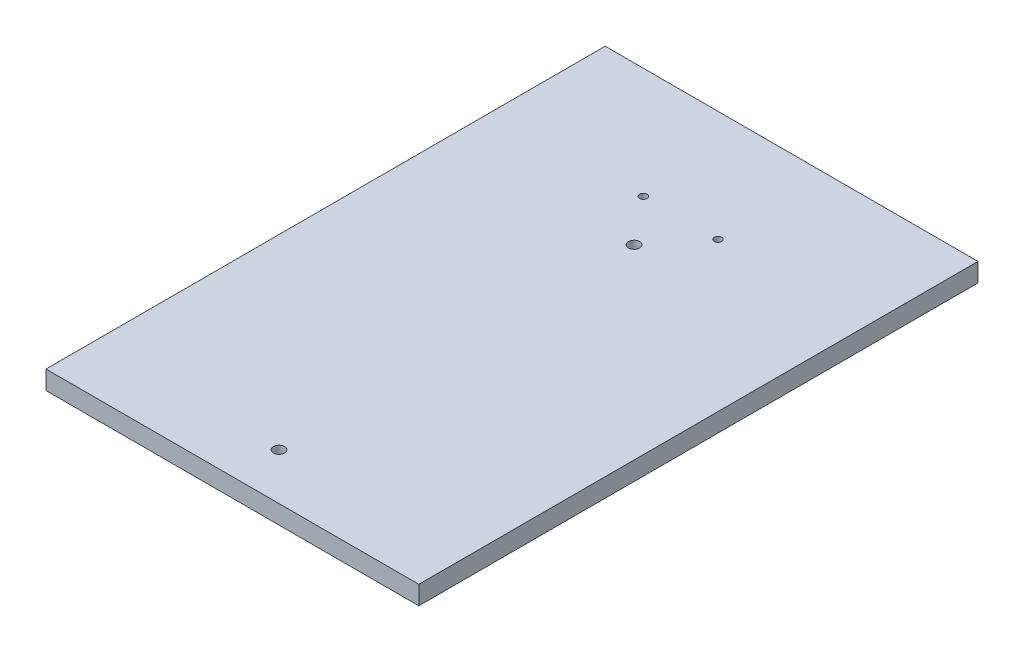
ISO-10303-21;
HEADER;
FILE_DESCRIPTION(('STEP AP214'),'2;1');
FILE_NAME('part.step','',(''),(''),'','','');
FILE_SCHEMA(('AUTOMOTIVE_DESIGN { 1 0 10303 214 1 1 1 1 }'));
ENDSEC;
DATA;
#1=APPLICATION_CONTEXT('core data for automotive mechanical design processes');
#2=APPLICATION_PROTOCOL_DEFINITION('international standard','automotive_design',2000,#1);
#3=PRODUCT_CONTEXT('',#1,'mechanical');
#4=PRODUCT('Part','Part','',(#3));
#5=PRODUCT_RELATED_PRODUCT_CATEGORY('part','',(#4));
#6=PRODUCT_DEFINITION_FORMATION('','',#4);
#7=PRODUCT_DEFINITION_CONTEXT('part definition',#1,'design');
#8=PRODUCT_DEFINITION('design','',#6,#7);
#9=PRODUCT_DEFINITION_SHAPE('','',#8);
#10=(LENGTH_UNIT() NAMED_UNIT(*) SI_UNIT(.MILLI.,.METRE.));
#11=(NAMED_UNIT(*) PLANE_ANGLE_UNIT() SI_UNIT($,.RADIAN.));
#12=(NAMED_UNIT(*) SI_UNIT($,.STERADIAN.) SOLID_ANGLE_UNIT());
#13=UNCERTAINTY_MEASURE_WITH_UNIT(LENGTH_MEASURE(1.E-05),#10,'distance_accuracy_value','');
#14=(GEOMETRIC_REPRESENTATION_CONTEXT(3) GLOBAL_UNCERTAINTY_ASSIGNED_CONTEXT((#13)) GLOBAL_UNIT_ASSIGNED_CONTEXT((#10,
#11,#12)) REPRESENTATION_CONTEXT('',''));
#15=CARTESIAN_POINT('',(0.,0.,0.));
#16=DIRECTION('',(0.,0.,1.));
#17=DIRECTION('',(1.,0.,0.));
#18=AXIS2_PLACEMENT_3D('',#15,#16,#17);
#19=CARTESIAN_POINT('',(-100.,10.,-150.));
#20=DIRECTION('',(1.,0.,0.));
#21=DIRECTION('',(0.,0.,-1.));
#22=AXIS2_PLACEMENT_3D('',#19,#20,#21);
#23=PLANE('',#22);
#24=DIRECTION('',(0.,0.,1.));
#25=VECTOR('',#24,1.);
#26=CARTESIAN_POINT('',(-100.,0.,-150.));
#27=LINE('',#26,#25);
#28=CARTESIAN_POINT('',(-100.,0.,-150.));
#29=VERTEX_POINT('',#28);
#30=CARTESIAN_POINT('',(-100.,0.,150.));
#31=VERTEX_POINT('',#30);
#32=EDGE_CURVE('E97',#29,#31,#27,.T.);
#33=ORIENTED_EDGE('',*,*,#32,.T.);
#34=DIRECTION('',(0.,-1.,0.));
#35=VECTOR('',#34,1.);
#36=CARTESIAN_POINT('',(-100.,10.,150.));
#37=LINE('',#36,#35);
#38=CARTESIAN_POINT('',(-100.,10.,150.));
#39=VERTEX_POINT('',#38);
#40=EDGE_CURVE('E11',#39,#31,#37,.T.);
#41=ORIENTED_EDGE('',*,*,#40,.F.);
#42=DIRECTION('',(0.,0.,1.));
#43=VECTOR('',#42,1.);
#44=CARTESIAN_POINT('',(-100.,10.,-150.));
#45=LINE('',#44,#43);
#46=CARTESIAN_POINT('',(-100.,10.,-150.));
#47=VERTEX_POINT('',#46);
#48=EDGE_CURVE('E85',#47,#39,#45,.T.);
#49=ORIENTED_EDGE('',*,*,#48,.F.);
#50=DIRECTION('',(0.,-1.,0.));
#51=VECTOR('',#50,1.);
#52=CARTESIAN_POINT('',(-100.,10.,-150.));
#53=LINE('',#52,#51);
#54=EDGE_CURVE('E93',#47,#29,#53,.T.);
#55=ORIENTED_EDGE('',*,*,#54,.T.);
#56=EDGE_LOOP('',(#33,#41,#49,#55));
#57=FACE_BOUND('',#56,.T.);
#58=ADVANCED_FACE('F34',(#57),#23,.F.);
#59=CARTESIAN_POINT('',(-100.,10.,150.));
#60=DIRECTION('',(0.,0.,-1.));
#61=DIRECTION('',(-1.,0.,0.));
#62=AXIS2_PLACEMENT_3D('',#59,#60,#61);
#63=PLANE('',#62);
#64=DIRECTION('',(1.,0.,0.));
#65=VECTOR('',#64,1.);
#66=CARTESIAN_POINT('',(-100.,0.,150.));
#67=LINE('',#66,#65);
#68=CARTESIAN_POINT('',(100.,0.,150.));
#69=VERTEX_POINT('',#68);
#70=EDGE_CURVE('E89',#31,#69,#67,.T.);
#71=ORIENTED_EDGE('',*,*,#70,.T.);
#72=DIRECTION('',(0.,-1.,0.));
#73=VECTOR('',#72,1.);
#74=CARTESIAN_POINT('',(100.,10.,150.));
#75=LINE('',#74,#73);
#76=CARTESIAN_POINT('',(100.,10.,150.));
#77=VERTEX_POINT('',#76);
#78=EDGE_CURVE('E42',#77,#69,#75,.T.);
#79=ORIENTED_EDGE('',*,*,#78,.F.);
#80=DIRECTION('',(1.,0.,0.));
#81=VECTOR('',#80,1.);
#82=CARTESIAN_POINT('',(-100.,10.,150.));
#83=LINE('',#82,#81);
#84=EDGE_CURVE('E80',#39,#77,#83,.T.);
#85=ORIENTED_EDGE('',*,*,#84,.F.);
#86=ORIENTED_EDGE('',*,*,#40,.T.);
#87=EDGE_LOOP('',(#71,#79,#85,#86));
#88=FACE_BOUND('',#87,.T.);
#89=ADVANCED_FACE('F88',(#88),#63,.F.);
#90=CARTESIAN_POINT('',(100.,10.,-150.));
#91=DIRECTION('',(-1.,0.,0.));
#92=DIRECTION('',(0.,0.,1.));
#93=AXIS2_PLACEMENT_3D('',#90,#91,#92);
#94=PLANE('',#93);
#95=DIRECTION('',(0.,0.,-1.));
#96=VECTOR('',#95,1.);
#97=CARTESIAN_POINT('',(100.,0.,-150.));
#98=LINE('',#97,#96);
#99=CARTESIAN_POINT('',(100.,0.,-150.));
#100=VERTEX_POINT('',#99);
#101=EDGE_CURVE('E67',#69,#100,#98,.T.);
#102=ORIENTED_EDGE('',*,*,#101,.T.);
#103=DIRECTION('',(0.,-1.,0.));
#104=VECTOR('',#103,1.);
#105=CARTESIAN_POINT('',(100.,10.,-150.));
#106=LINE('',#105,#104);
#107=CARTESIAN_POINT('',(100.,10.,-150.));
#108=VERTEX_POINT('',#107);
#109=EDGE_CURVE('E90',#108,#100,#106,.T.);
#110=ORIENTED_EDGE('',*,*,#109,.F.);
#111=DIRECTION('',(0.,0.,-1.));
#112=VECTOR('',#111,1.);
#113=CARTESIAN_POINT('',(100.,10.,-150.));
#114=LINE('',#113,#112);
#115=EDGE_CURVE('E83',#77,#108,#114,.T.);
#116=ORIENTED_EDGE('',*,*,#115,.F.);
#117=ORIENTED_EDGE('',*,*,#78,.T.);
#118=EDGE_LOOP('',(#102,#110,#116,#117));
#119=FACE_BOUND('',#118,.T.);
#120=ADVANCED_FACE('F91',(#119),#94,.F.);
#121=CARTESIAN_POINT('',(-100.,10.,-150.));
#122=DIRECTION('',(0.,0.,1.));
#123=DIRECTION('',(1.,0.,0.));
#124=AXIS2_PLACEMENT_3D('',#121,#122,#123);
#125=PLANE('',#124);
#126=DIRECTION('',(-1.,0.,0.));
#127=VECTOR('',#126,1.);
#128=CARTESIAN_POINT('',(-100.,0.,-150.));
#129=LINE('',#128,#127);
#130=EDGE_CURVE('E73',#100,#29,#129,.T.);
#131=ORIENTED_EDGE('',*,*,#130,.T.);
#132=ORIENTED_EDGE('',*,*,#54,.F.);
#133=DIRECTION('',(-1.,0.,0.));
#134=VECTOR('',#133,1.);
#135=CARTESIAN_POINT('',(-100.,10.,-150.));
#136=LINE('',#135,#134);
#137=EDGE_CURVE('E50',#108,#47,#136,.T.);
#138=ORIENTED_EDGE('',*,*,#137,.F.);
#139=ORIENTED_EDGE('',*,*,#109,.T.);
#140=EDGE_LOOP('',(#131,#132,#138,#139));
#141=FACE_BOUND('',#140,.T.);
#142=ADVANCED_FACE('F105',(#141),#125,.F.);
#143=CARTESIAN_POINT('',(0.,10.,0.));
#144=DIRECTION('',(0.,1.,0.));
#145=DIRECTION('',(0.,0.,1.));
#146=AXIS2_PLACEMENT_3D('',#143,#144,#145);
#147=PLANE('',#146);
#148=CARTESIAN_POINT('',(20.,10.,-90.5));
#149=DIRECTION('',(0.,1.,0.));
#150=DIRECTION('',(0.,0.,1.));
#151=AXIS2_PLACEMENT_3D('',#148,#149,#150);
#152=CIRCLE('',#151,2.00000000000001);
#153=CARTESIAN_POINT('',(20.,10.,-88.5));
#154=VERTEX_POINT('',#153);
#155=EDGE_CURVE('E129',#154,#154,#152,.T.);
#156=ORIENTED_EDGE('',*,*,#155,.F.);
#157=EDGE_LOOP('',(#156));
#158=FACE_BOUND('',#157,.T.);
#159=CARTESIAN_POINT('',(-20.,10.,-90.5));
#160=DIRECTION('',(0.,1.,0.));
#161=DIRECTION('',(0.,0.,1.));
#162=AXIS2_PLACEMENT_3D('',#159,#160,#161);
#163=CIRCLE('',#162,2.00000000000001);
#164=CARTESIAN_POINT('',(-20.,10.,-88.5));
#165=VERTEX_POINT('',#164);
#166=EDGE_CURVE('E123',#165,#165,#163,.T.);
#167=ORIENTED_EDGE('',*,*,#166,.F.);
#168=EDGE_LOOP('',(#167));
#169=FACE_BOUND('',#168,.T.);
#170=CARTESIAN_POINT('',(0.,10.,-65.5));
#171=DIRECTION('',(0.,1.,0.));
#172=DIRECTION('',(0.,0.,1.));
#173=AXIS2_PLACEMENT_3D('',#170,#171,#172);
#174=CIRCLE('',#173,3.);
#175=CARTESIAN_POINT('',(0.,10.,-62.5));
#176=VERTEX_POINT('',#175);
#177=EDGE_CURVE('E117',#176,#176,#174,.T.);
#178=ORIENTED_EDGE('',*,*,#177,.F.);
#179=EDGE_LOOP('',(#178));
#180=FACE_BOUND('',#179,.T.);
#181=CARTESIAN_POINT('',(0.,10.,125.));
#182=DIRECTION('',(0.,1.,0.));
#183=DIRECTION('',(0.,0.,1.));
#184=AXIS2_PLACEMENT_3D('',#181,#182,#183);
#185=CIRCLE('',#184,3.);
#186=CARTESIAN_POINT('',(0.,10.,128.));
#187=VERTEX_POINT('',#186);
#188=EDGE_CURVE('E111',#187,#187,#185,.T.);
#189=ORIENTED_EDGE('',*,*,#188,.F.);
#190=EDGE_LOOP('',(#189));
#191=FACE_BOUND('',#190,.T.);
#192=ORIENTED_EDGE('',*,*,#48,.T.);
#193=ORIENTED_EDGE('',*,*,#84,.T.);
#194=ORIENTED_EDGE('',*,*,#115,.T.);
#195=ORIENTED_EDGE('',*,*,#137,.T.);
#196=EDGE_LOOP('',(#192,#193,#194,#195));
#197=FACE_BOUND('',#196,.T.);
#198=ADVANCED_FACE('F81',(#158,#169,#180,#191,#197),#147,.T.);
#199=CARTESIAN_POINT('',(0.,0.,0.));
#200=DIRECTION('',(0.,1.,0.));
#201=DIRECTION('',(0.,0.,1.));
#202=AXIS2_PLACEMENT_3D('',#199,#200,#201);
#203=PLANE('',#202);
#204=CARTESIAN_POINT('',(20.,0.,-90.5));
#205=DIRECTION('',(0.,1.,0.));
#206=DIRECTION('',(0.,0.,1.));
#207=AXIS2_PLACEMENT_3D('',#204,#205,#206);
#208=CIRCLE('',#207,2.00000000000001);
#209=CARTESIAN_POINT('',(20.,0.,-88.5));
#210=VERTEX_POINT('',#209);
#211=EDGE_CURVE('E126',#210,#210,#208,.T.);
#212=ORIENTED_EDGE('',*,*,#211,.T.);
#213=EDGE_LOOP('',(#212));
#214=FACE_BOUND('',#213,.T.);
#215=CARTESIAN_POINT('',(-20.,0.,-90.5));
#216=DIRECTION('',(0.,1.,0.));
#217=DIRECTION('',(0.,0.,1.));
#218=AXIS2_PLACEMENT_3D('',#215,#216,#217);
#219=CIRCLE('',#218,2.00000000000001);
#220=CARTESIAN_POINT('',(-20.,0.,-88.5));
#221=VERTEX_POINT('',#220);
#222=EDGE_CURVE('E120',#221,#221,#219,.T.);
#223=ORIENTED_EDGE('',*,*,#222,.T.);
#224=EDGE_LOOP('',(#223));
#225=FACE_BOUND('',#224,.T.);
#226=CARTESIAN_POINT('',(0.,0.,-65.5));
#227=DIRECTION('',(0.,1.,0.));
#228=DIRECTION('',(0.,0.,1.));
#229=AXIS2_PLACEMENT_3D('',#226,#227,#228);
#230=CIRCLE('',#229,3.);
#231=CARTESIAN_POINT('',(0.,0.,-62.5));
#232=VERTEX_POINT('',#231);
#233=EDGE_CURVE('E114',#232,#232,#230,.T.);
#234=ORIENTED_EDGE('',*,*,#233,.T.);
#235=EDGE_LOOP('',(#234));
#236=FACE_BOUND('',#235,.T.);
#237=CARTESIAN_POINT('',(0.,0.,125.));
#238=DIRECTION('',(0.,1.,0.));
#239=DIRECTION('',(0.,0.,1.));
#240=AXIS2_PLACEMENT_3D('',#237,#238,#239);
#241=CIRCLE('',#240,3.);
#242=CARTESIAN_POINT('',(0.,0.,128.));
#243=VERTEX_POINT('',#242);
#244=EDGE_CURVE('E100',#243,#243,#241,.T.);
#245=ORIENTED_EDGE('',*,*,#244,.T.);
#246=EDGE_LOOP('',(#245));
#247=FACE_BOUND('',#246,.T.);
#248=ORIENTED_EDGE('',*,*,#32,.F.);
#249=ORIENTED_EDGE('',*,*,#130,.F.);
#250=ORIENTED_EDGE('',*,*,#101,.F.);
#251=ORIENTED_EDGE('',*,*,#70,.F.);
#252=EDGE_LOOP('',(#248,#249,#250,#251));
#253=FACE_BOUND('',#252,.T.);
#254=ADVANCED_FACE('F108',(#214,#225,#236,#247,#253),#203,.F.);
#255=CARTESIAN_POINT('',(0.,0.,125.));
#256=DIRECTION('',(0.,1.,0.));
#257=DIRECTION('',(0.,0.,1.));
#258=AXIS2_PLACEMENT_3D('',#255,#256,#257);
#259=CYLINDRICAL_SURFACE('',#258,3.);
#260=ORIENTED_EDGE('',*,*,#244,.F.);
#261=EDGE_LOOP('',(#260));
#262=FACE_BOUND('',#261,.T.);
#263=ORIENTED_EDGE('',*,*,#188,.T.);
#264=EDGE_LOOP('',(#263));
#265=FACE_BOUND('',#264,.T.);
#266=ADVANCED_FACE('F153',(#262,#265),#259,.F.);
#267=CARTESIAN_POINT('',(0.,0.,-65.5));
#268=DIRECTION('',(0.,1.,0.));
#269=DIRECTION('',(0.,0.,1.));
#270=AXIS2_PLACEMENT_3D('',#267,#268,#269);
#271=CYLINDRICAL_SURFACE('',#270,3.);
#272=ORIENTED_EDGE('',*,*,#233,.F.);
#273=EDGE_LOOP('',(#272));
#274=FACE_BOUND('',#273,.T.);
#275=ORIENTED_EDGE('',*,*,#177,.T.);
#276=EDGE_LOOP('',(#275));
#277=FACE_BOUND('',#276,.T.);
#278=ADVANCED_FACE('F155',(#274,#277),#271,.F.);
#279=CARTESIAN_POINT('',(-20.,0.,-90.5));
#280=DIRECTION('',(0.,1.,0.));
#281=DIRECTION('',(0.,0.,1.));
#282=AXIS2_PLACEMENT_3D('',#279,#280,#281);
#283=CYLINDRICAL_SURFACE('',#282,2.00000000000001);
#284=ORIENTED_EDGE('',*,*,#222,.F.);
#285=EDGE_LOOP('',(#284));
#286=FACE_BOUND('',#285,.T.);
#287=ORIENTED_EDGE('',*,*,#166,.T.);
#288=EDGE_LOOP('',(#287));
#289=FACE_BOUND('',#288,.T.);
#290=ADVANCED_FACE('F140',(#286,#289),#283,.F.);
#291=CARTESIAN_POINT('',(20.,0.,-90.5));
#292=DIRECTION('',(0.,1.,0.));
#293=DIRECTION('',(0.,0.,1.));
#294=AXIS2_PLACEMENT_3D('',#291,#292,#293);
#295=CYLINDRICAL_SURFACE('',#294,2.00000000000001);
#296=ORIENTED_EDGE('',*,*,#211,.F.);
#297=EDGE_LOOP('',(#296));
#298=FACE_BOUND('',#297,.T.);
#299=ORIENTED_EDGE('',*,*,#155,.T.);
#300=EDGE_LOOP('',(#299));
#301=FACE_BOUND('',#300,.T.);
#302=ADVANCED_FACE('F137',(#298,#301),#295,.F.);
#303=CLOSED_SHELL('',(#58,#89,#120,#142,#198,#254,#266,#278,#290,#302));
#304=MANIFOLD_SOLID_BREP('B2',#303);
#305=ADVANCED_BREP_SHAPE_REPRESENTATION('',(#18,#304),#14);
#306=SHAPE_DEFINITION_REPRESENTATION(#9,#305);
ENDSEC;
END-ISO-10303-21;
